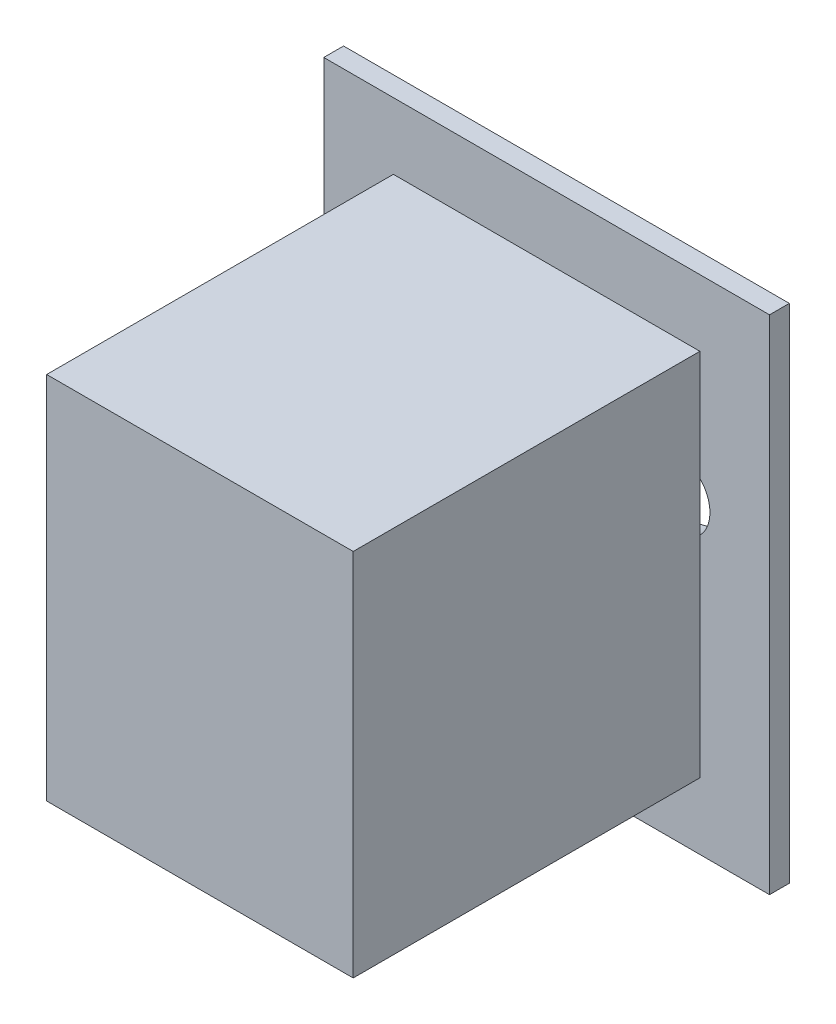
ISO-10303-21;
HEADER;
FILE_DESCRIPTION(('STEP AP214'),'2;1');
FILE_NAME('part.step','',(''),(''),'','','');
FILE_SCHEMA(('AUTOMOTIVE_DESIGN { 1 0 10303 214 1 1 1 1 }'));
ENDSEC;
DATA;
#1=APPLICATION_CONTEXT('core data for automotive mechanical design processes');
#2=APPLICATION_PROTOCOL_DEFINITION('international standard','automotive_design',2000,#1);
#3=PRODUCT_CONTEXT('',#1,'mechanical');
#4=PRODUCT('Part','Part','',(#3));
#5=PRODUCT_RELATED_PRODUCT_CATEGORY('part','',(#4));
#6=PRODUCT_DEFINITION_FORMATION('','',#4);
#7=PRODUCT_DEFINITION_CONTEXT('part definition',#1,'design');
#8=PRODUCT_DEFINITION('design','',#6,#7);
#9=PRODUCT_DEFINITION_SHAPE('','',#8);
#10=(LENGTH_UNIT() NAMED_UNIT(*) SI_UNIT(.MILLI.,.METRE.));
#11=(NAMED_UNIT(*) PLANE_ANGLE_UNIT() SI_UNIT($,.RADIAN.));
#12=(NAMED_UNIT(*) SI_UNIT($,.STERADIAN.) SOLID_ANGLE_UNIT());
#13=UNCERTAINTY_MEASURE_WITH_UNIT(LENGTH_MEASURE(1.E-05),#10,'distance_accuracy_value','');
#14=(GEOMETRIC_REPRESENTATION_CONTEXT(3) GLOBAL_UNCERTAINTY_ASSIGNED_CONTEXT((#13)) GLOBAL_UNIT_ASSIGNED_CONTEXT((#10,
#11,#12)) REPRESENTATION_CONTEXT('',''));
#15=CARTESIAN_POINT('',(0.,0.,0.));
#16=DIRECTION('',(0.,0.,1.));
#17=DIRECTION('',(1.,0.,0.));
#18=AXIS2_PLACEMENT_3D('',#15,#16,#17);
#19=CARTESIAN_POINT('',(0.,0.,2.));
#20=DIRECTION('',(0.,0.,-1.));
#21=DIRECTION('',(-1.,0.,0.));
#22=AXIS2_PLACEMENT_3D('',#19,#20,#21);
#23=PLANE('',#22);
#24=DIRECTION('',(0.,1.,0.));
#25=VECTOR('',#24,1.);
#26=CARTESIAN_POINT('',(22.5,-25.35,2.));
#27=LINE('',#26,#25);
#28=CARTESIAN_POINT('',(22.5,-25.35,2.));
#29=VERTEX_POINT('',#28);
#30=CARTESIAN_POINT('',(22.5,25.35,2.));
#31=VERTEX_POINT('',#30);
#32=EDGE_CURVE('E174',#29,#31,#27,.T.);
#33=ORIENTED_EDGE('',*,*,#32,.T.);
#34=DIRECTION('',(-1.,0.,0.));
#35=VECTOR('',#34,1.);
#36=CARTESIAN_POINT('',(-22.5,25.35,2.));
#37=LINE('',#36,#35);
#38=CARTESIAN_POINT('',(-22.5,25.35,2.));
#39=VERTEX_POINT('',#38);
#40=EDGE_CURVE('E177',#31,#39,#37,.T.);
#41=ORIENTED_EDGE('',*,*,#40,.T.);
#42=DIRECTION('',(0.,-1.,0.));
#43=VECTOR('',#42,1.);
#44=CARTESIAN_POINT('',(-22.5,-25.35,2.));
#45=LINE('',#44,#43);
#46=CARTESIAN_POINT('',(-22.5,-25.35,2.));
#47=VERTEX_POINT('',#46);
#48=EDGE_CURVE('E180',#39,#47,#45,.T.);
#49=ORIENTED_EDGE('',*,*,#48,.T.);
#50=DIRECTION('',(1.,0.,0.));
#51=VECTOR('',#50,1.);
#52=CARTESIAN_POINT('',(-22.5,-25.35,2.));
#53=LINE('',#52,#51);
#54=EDGE_CURVE('E182',#47,#29,#53,.T.);
#55=ORIENTED_EDGE('',*,*,#54,.T.);
#56=EDGE_LOOP('',(#33,#41,#49,#55));
#57=FACE_BOUND('',#56,.T.);
#58=DIRECTION('',(0.,1.,0.));
#59=VECTOR('',#58,1.);
#60=CARTESIAN_POINT('',(15.4718309454211,-18.6460204089014,2.));
#61=LINE('',#60,#59);
#62=CARTESIAN_POINT('',(15.4718309454211,-18.6460204089014,2.));
#63=VERTEX_POINT('',#62);
#64=CARTESIAN_POINT('',(15.4718309454211,2.56396348932195,2.));
#65=VERTEX_POINT('',#64);
#66=EDGE_CURVE('E52',#63,#65,#61,.T.);
#67=ORIENTED_EDGE('',*,*,#66,.F.);
#68=DIRECTION('',(1.,0.,0.));
#69=VECTOR('',#68,1.);
#70=CARTESIAN_POINT('',(-15.4718309454211,-18.6460204089014,2.));
#71=LINE('',#70,#69);
#72=CARTESIAN_POINT('',(-15.4718309454211,-18.6460204089014,2.));
#73=VERTEX_POINT('',#72);
#74=EDGE_CURVE('E56',#73,#63,#71,.T.);
#75=ORIENTED_EDGE('',*,*,#74,.F.);
#76=DIRECTION('',(0.,-1.,0.));
#77=VECTOR('',#76,1.);
#78=CARTESIAN_POINT('',(-15.4718309454211,-18.6460204089014,2.));
#79=LINE('',#78,#77);
#80=CARTESIAN_POINT('',(-15.4718309454211,2.56396348932196,2.));
#81=VERTEX_POINT('',#80);
#82=EDGE_CURVE('E11',#81,#73,#79,.T.);
#83=ORIENTED_EDGE('',*,*,#82,.F.);
#84=CARTESIAN_POINT('',(-12.9328988192172,5.05104631995179,2.));
#85=DIRECTION('',(0.,0.,1.));
#86=DIRECTION('',(1.,0.,0.));
#87=AXIS2_PLACEMENT_3D('',#84,#85,#86);
#88=CIRCLE('',#87,3.55411836436036);
#89=CARTESIAN_POINT('',(-15.4718309454211,7.53812915058162,2.));
#90=VERTEX_POINT('',#89);
#91=EDGE_CURVE('E162',#90,#81,#88,.T.);
#92=ORIENTED_EDGE('',*,*,#91,.F.);
#93=CARTESIAN_POINT('',(-15.4718309454211,18.6460204089014,2.));
#94=VERTEX_POINT('',#93);
#95=EDGE_CURVE('E44',#94,#90,#79,.T.);
#96=ORIENTED_EDGE('',*,*,#95,.F.);
#97=DIRECTION('',(-1.,0.,0.));
#98=VECTOR('',#97,1.);
#99=CARTESIAN_POINT('',(-15.4718309454211,18.6460204089014,2.));
#100=LINE('',#99,#98);
#101=CARTESIAN_POINT('',(15.4718309454211,18.6460204089014,2.));
#102=VERTEX_POINT('',#101);
#103=EDGE_CURVE('E209',#102,#94,#100,.T.);
#104=ORIENTED_EDGE('',*,*,#103,.F.);
#105=CARTESIAN_POINT('',(15.4718309454211,7.53812915058163,2.));
#106=VERTEX_POINT('',#105);
#107=EDGE_CURVE('E42',#106,#102,#61,.T.);
#108=ORIENTED_EDGE('',*,*,#107,.F.);
#109=CARTESIAN_POINT('',(12.9328988192172,5.05104631995179,2.));
#110=DIRECTION('',(0.,0.,1.));
#111=DIRECTION('',(-1.,0.,0.));
#112=AXIS2_PLACEMENT_3D('',#109,#110,#111);
#113=CIRCLE('',#112,3.55411836436037);
#114=EDGE_CURVE('E145',#65,#106,#113,.T.);
#115=ORIENTED_EDGE('',*,*,#114,.F.);
#116=EDGE_LOOP('',(#67,#75,#83,#92,#96,#104,#108,#115));
#117=FACE_BOUND('',#116,.T.);
#118=ADVANCED_FACE('F33',(#57,#117),#23,.F.);
#119=CARTESIAN_POINT('',(0.,0.,0.));
#120=DIRECTION('',(0.,0.,-1.));
#121=DIRECTION('',(-1.,0.,0.));
#122=AXIS2_PLACEMENT_3D('',#119,#120,#121);
#123=PLANE('',#122);
#124=CARTESIAN_POINT('',(9.04747857310047,-11.6007547348343,0.));
#125=DIRECTION('',(0.,0.,1.));
#126=DIRECTION('',(-1.,0.,0.));
#127=AXIS2_PLACEMENT_3D('',#124,#125,#126);
#128=CIRCLE('',#127,2.98908976718799);
#129=CARTESIAN_POINT('',(6.05838880591249,-11.6007547348343,0.));
#130=VERTEX_POINT('',#129);
#131=EDGE_CURVE('E148',#130,#130,#128,.T.);
#132=ORIENTED_EDGE('',*,*,#131,.T.);
#133=EDGE_LOOP('',(#132));
#134=FACE_BOUND('',#133,.T.);
#135=CARTESIAN_POINT('',(-12.9328988192172,5.05104631995179,0.));
#136=DIRECTION('',(0.,0.,1.));
#137=DIRECTION('',(1.,0.,0.));
#138=AXIS2_PLACEMENT_3D('',#135,#136,#137);
#139=CIRCLE('',#138,3.55411836436036);
#140=CARTESIAN_POINT('',(-9.37878045485687,5.05104631995179,0.));
#141=VERTEX_POINT('',#140);
#142=EDGE_CURVE('E161',#141,#141,#139,.T.);
#143=ORIENTED_EDGE('',*,*,#142,.T.);
#144=EDGE_LOOP('',(#143));
#145=FACE_BOUND('',#144,.T.);
#146=DIRECTION('',(0.,1.,0.));
#147=VECTOR('',#146,1.);
#148=CARTESIAN_POINT('',(22.5,-25.35,0.));
#149=LINE('',#148,#147);
#150=CARTESIAN_POINT('',(22.5,-25.35,0.));
#151=VERTEX_POINT('',#150);
#152=CARTESIAN_POINT('',(22.5,25.35,0.));
#153=VERTEX_POINT('',#152);
#154=EDGE_CURVE('E173',#151,#153,#149,.T.);
#155=ORIENTED_EDGE('',*,*,#154,.F.);
#156=DIRECTION('',(1.,0.,0.));
#157=VECTOR('',#156,1.);
#158=CARTESIAN_POINT('',(-22.5,-25.35,0.));
#159=LINE('',#158,#157);
#160=CARTESIAN_POINT('',(-22.5,-25.35,0.));
#161=VERTEX_POINT('',#160);
#162=EDGE_CURVE('E178',#161,#151,#159,.T.);
#163=ORIENTED_EDGE('',*,*,#162,.F.);
#164=DIRECTION('',(0.,-1.,0.));
#165=VECTOR('',#164,1.);
#166=CARTESIAN_POINT('',(-22.5,-25.35,0.));
#167=LINE('',#166,#165);
#168=CARTESIAN_POINT('',(-22.5,25.35,0.));
#169=VERTEX_POINT('',#168);
#170=EDGE_CURVE('E189',#169,#161,#167,.T.);
#171=ORIENTED_EDGE('',*,*,#170,.F.);
#172=DIRECTION('',(-1.,0.,0.));
#173=VECTOR('',#172,1.);
#174=CARTESIAN_POINT('',(-22.5,25.35,0.));
#175=LINE('',#174,#173);
#176=EDGE_CURVE('E187',#153,#169,#175,.T.);
#177=ORIENTED_EDGE('',*,*,#176,.F.);
#178=EDGE_LOOP('',(#155,#163,#171,#177));
#179=FACE_BOUND('',#178,.T.);
#180=CARTESIAN_POINT('',(0.,15.621214426785,0.));
#181=DIRECTION('',(0.,0.,1.));
#182=DIRECTION('',(1.,0.,0.));
#183=AXIS2_PLACEMENT_3D('',#180,#181,#182);
#184=CIRCLE('',#183,2.63697333588881);
#185=CARTESIAN_POINT('',(2.63697333588882,15.621214426785,0.));
#186=VERTEX_POINT('',#185);
#187=EDGE_CURVE('E165',#186,#186,#184,.T.);
#188=ORIENTED_EDGE('',*,*,#187,.T.);
#189=EDGE_LOOP('',(#188));
#190=FACE_BOUND('',#189,.T.);
#191=CARTESIAN_POINT('',(-9.04747857310047,-11.6007547348343,0.));
#192=DIRECTION('',(0.,0.,1.));
#193=DIRECTION('',(1.,0.,0.));
#194=AXIS2_PLACEMENT_3D('',#191,#192,#193);
#195=CIRCLE('',#194,2.98908976718798);
#196=CARTESIAN_POINT('',(-6.05838880591248,-11.6007547348343,0.));
#197=VERTEX_POINT('',#196);
#198=EDGE_CURVE('E156',#197,#197,#195,.T.);
#199=ORIENTED_EDGE('',*,*,#198,.T.);
#200=EDGE_LOOP('',(#199));
#201=FACE_BOUND('',#200,.T.);
#202=CARTESIAN_POINT('',(12.9328988192172,5.05104631995179,0.));
#203=DIRECTION('',(0.,0.,1.));
#204=DIRECTION('',(-1.,0.,0.));
#205=AXIS2_PLACEMENT_3D('',#202,#203,#204);
#206=CIRCLE('',#205,3.55411836436037);
#207=CARTESIAN_POINT('',(9.37878045485687,5.05104631995179,0.));
#208=VERTEX_POINT('',#207);
#209=EDGE_CURVE('E150',#208,#208,#206,.T.);
#210=ORIENTED_EDGE('',*,*,#209,.T.);
#211=EDGE_LOOP('',(#210));
#212=FACE_BOUND('',#211,.T.);
#213=ADVANCED_FACE('F253',(#134,#145,#179,#190,#201,#212),#123,.T.);
#214=CARTESIAN_POINT('',(22.5,-25.35,2.));
#215=DIRECTION('',(-1.,0.,0.));
#216=DIRECTION('',(0.,0.,1.));
#217=AXIS2_PLACEMENT_3D('',#214,#215,#216);
#218=PLANE('',#217);
#219=ORIENTED_EDGE('',*,*,#154,.T.);
#220=DIRECTION('',(0.,0.,-1.));
#221=VECTOR('',#220,1.);
#222=CARTESIAN_POINT('',(22.5,25.35,2.));
#223=LINE('',#222,#221);
#224=EDGE_CURVE('E37',#31,#153,#223,.T.);
#225=ORIENTED_EDGE('',*,*,#224,.F.);
#226=ORIENTED_EDGE('',*,*,#32,.F.);
#227=DIRECTION('',(0.,0.,-1.));
#228=VECTOR('',#227,1.);
#229=CARTESIAN_POINT('',(22.5,-25.35,2.));
#230=LINE('',#229,#228);
#231=EDGE_CURVE('E184',#29,#151,#230,.T.);
#232=ORIENTED_EDGE('',*,*,#231,.T.);
#233=EDGE_LOOP('',(#219,#225,#226,#232));
#234=FACE_BOUND('',#233,.T.);
#235=ADVANCED_FACE('F35',(#234),#218,.F.);
#236=CARTESIAN_POINT('',(-22.5,25.35,2.));
#237=DIRECTION('',(0.,-1.,0.));
#238=DIRECTION('',(0.,0.,-1.));
#239=AXIS2_PLACEMENT_3D('',#236,#237,#238);
#240=PLANE('',#239);
#241=ORIENTED_EDGE('',*,*,#176,.T.);
#242=DIRECTION('',(0.,0.,-1.));
#243=VECTOR('',#242,1.);
#244=CARTESIAN_POINT('',(-22.5,25.35,2.));
#245=LINE('',#244,#243);
#246=EDGE_CURVE('E196',#39,#169,#245,.T.);
#247=ORIENTED_EDGE('',*,*,#246,.F.);
#248=ORIENTED_EDGE('',*,*,#40,.F.);
#249=ORIENTED_EDGE('',*,*,#224,.T.);
#250=EDGE_LOOP('',(#241,#247,#248,#249));
#251=FACE_BOUND('',#250,.T.);
#252=ADVANCED_FACE('F273',(#251),#240,.F.);
#253=CARTESIAN_POINT('',(-22.5,-25.35,2.));
#254=DIRECTION('',(1.,0.,0.));
#255=DIRECTION('',(0.,0.,-1.));
#256=AXIS2_PLACEMENT_3D('',#253,#254,#255);
#257=PLANE('',#256);
#258=ORIENTED_EDGE('',*,*,#170,.T.);
#259=DIRECTION('',(0.,0.,-1.));
#260=VECTOR('',#259,1.);
#261=CARTESIAN_POINT('',(-22.5,-25.35,2.));
#262=LINE('',#261,#260);
#263=EDGE_CURVE('E194',#47,#161,#262,.T.);
#264=ORIENTED_EDGE('',*,*,#263,.F.);
#265=ORIENTED_EDGE('',*,*,#48,.F.);
#266=ORIENTED_EDGE('',*,*,#246,.T.);
#267=EDGE_LOOP('',(#258,#264,#265,#266));
#268=FACE_BOUND('',#267,.T.);
#269=ADVANCED_FACE('F270',(#268),#257,.F.);
#270=CARTESIAN_POINT('',(-22.5,-25.35,2.));
#271=DIRECTION('',(0.,1.,0.));
#272=DIRECTION('',(0.,0.,1.));
#273=AXIS2_PLACEMENT_3D('',#270,#271,#272);
#274=PLANE('',#273);
#275=ORIENTED_EDGE('',*,*,#162,.T.);
#276=ORIENTED_EDGE('',*,*,#231,.F.);
#277=ORIENTED_EDGE('',*,*,#54,.F.);
#278=ORIENTED_EDGE('',*,*,#263,.T.);
#279=EDGE_LOOP('',(#275,#276,#277,#278));
#280=FACE_BOUND('',#279,.T.);
#281=ADVANCED_FACE('F267',(#280),#274,.F.);
#282=CARTESIAN_POINT('',(0.,15.621214426785,2.));
#283=DIRECTION('',(0.,0.,-1.));
#284=DIRECTION('',(-1.,0.,0.));
#285=AXIS2_PLACEMENT_3D('',#282,#283,#284);
#286=CYLINDRICAL_SURFACE('',#285,2.63697333588881);
#287=CARTESIAN_POINT('',(0.,15.621214426785,2.));
#288=DIRECTION('',(0.,0.,1.));
#289=DIRECTION('',(1.,0.,0.));
#290=AXIS2_PLACEMENT_3D('',#287,#288,#289);
#291=CIRCLE('',#290,2.63697333588881);
#292=CARTESIAN_POINT('',(2.63697333588882,15.621214426785,2.));
#293=VERTEX_POINT('',#292);
#294=EDGE_CURVE('E152',#293,#293,#291,.T.);
#295=ORIENTED_EDGE('',*,*,#294,.T.);
#296=EDGE_LOOP('',(#295));
#297=FACE_BOUND('',#296,.T.);
#298=ORIENTED_EDGE('',*,*,#187,.F.);
#299=EDGE_LOOP('',(#298));
#300=FACE_BOUND('',#299,.T.);
#301=ADVANCED_FACE('F264',(#297,#300),#286,.F.);
#302=CARTESIAN_POINT('',(-12.9328988192172,5.05104631995179,2.));
#303=DIRECTION('',(0.,0.,-1.));
#304=DIRECTION('',(-1.,0.,0.));
#305=AXIS2_PLACEMENT_3D('',#302,#303,#304);
#306=CYLINDRICAL_SURFACE('',#305,3.55411836436036);
#307=ORIENTED_EDGE('',*,*,#91,.T.);
#308=EDGE_CURVE('E166',#81,#90,#88,.T.);
#309=ORIENTED_EDGE('',*,*,#308,.T.);
#310=EDGE_LOOP('',(#307,#309));
#311=FACE_BOUND('',#310,.T.);
#312=ORIENTED_EDGE('',*,*,#142,.F.);
#313=EDGE_LOOP('',(#312));
#314=FACE_BOUND('',#313,.T.);
#315=ADVANCED_FACE('F232',(#311,#314),#306,.F.);
#316=CARTESIAN_POINT('',(-9.04747857310047,-11.6007547348343,2.));
#317=DIRECTION('',(0.,0.,-1.));
#318=DIRECTION('',(-1.,0.,0.));
#319=AXIS2_PLACEMENT_3D('',#316,#317,#318);
#320=CYLINDRICAL_SURFACE('',#319,2.98908976718798);
#321=CARTESIAN_POINT('',(-9.04747857310047,-11.6007547348343,2.));
#322=DIRECTION('',(0.,0.,1.));
#323=DIRECTION('',(1.,0.,0.));
#324=AXIS2_PLACEMENT_3D('',#321,#322,#323);
#325=CIRCLE('',#324,2.98908976718798);
#326=CARTESIAN_POINT('',(-6.05838880591248,-11.6007547348343,2.));
#327=VERTEX_POINT('',#326);
#328=EDGE_CURVE('E139',#327,#327,#325,.T.);
#329=ORIENTED_EDGE('',*,*,#328,.T.);
#330=EDGE_LOOP('',(#329));
#331=FACE_BOUND('',#330,.T.);
#332=ORIENTED_EDGE('',*,*,#198,.F.);
#333=EDGE_LOOP('',(#332));
#334=FACE_BOUND('',#333,.T.);
#335=ADVANCED_FACE('F300',(#331,#334),#320,.F.);
#336=CARTESIAN_POINT('',(9.04747857310047,-11.6007547348343,2.));
#337=DIRECTION('',(0.,0.,-1.));
#338=DIRECTION('',(-1.,0.,0.));
#339=AXIS2_PLACEMENT_3D('',#336,#337,#338);
#340=CYLINDRICAL_SURFACE('',#339,2.98908976718799);
#341=CARTESIAN_POINT('',(9.04747857310047,-11.6007547348343,2.));
#342=DIRECTION('',(0.,0.,1.));
#343=DIRECTION('',(-1.,0.,0.));
#344=AXIS2_PLACEMENT_3D('',#341,#342,#343);
#345=CIRCLE('',#344,2.98908976718799);
#346=CARTESIAN_POINT('',(6.05838880591249,-11.6007547348343,2.));
#347=VERTEX_POINT('',#346);
#348=EDGE_CURVE('E136',#347,#347,#345,.T.);
#349=ORIENTED_EDGE('',*,*,#348,.T.);
#350=EDGE_LOOP('',(#349));
#351=FACE_BOUND('',#350,.T.);
#352=ORIENTED_EDGE('',*,*,#131,.F.);
#353=EDGE_LOOP('',(#352));
#354=FACE_BOUND('',#353,.T.);
#355=ADVANCED_FACE('F293',(#351,#354),#340,.F.);
#356=CARTESIAN_POINT('',(12.9328988192172,5.05104631995179,2.));
#357=DIRECTION('',(0.,0.,-1.));
#358=DIRECTION('',(-1.,0.,0.));
#359=AXIS2_PLACEMENT_3D('',#356,#357,#358);
#360=CYLINDRICAL_SURFACE('',#359,3.55411836436037);
#361=ORIENTED_EDGE('',*,*,#114,.T.);
#362=EDGE_CURVE('E149',#106,#65,#113,.T.);
#363=ORIENTED_EDGE('',*,*,#362,.T.);
#364=EDGE_LOOP('',(#361,#363));
#365=FACE_BOUND('',#364,.T.);
#366=ORIENTED_EDGE('',*,*,#209,.F.);
#367=EDGE_LOOP('',(#366));
#368=FACE_BOUND('',#367,.T.);
#369=ADVANCED_FACE('F215',(#365,#368),#360,.F.);
#370=CARTESIAN_POINT('',(0.,0.,37.));
#371=DIRECTION('',(0.,0.,-1.));
#372=DIRECTION('',(-1.,0.,0.));
#373=AXIS2_PLACEMENT_3D('',#370,#371,#372);
#374=PLANE('',#373);
#375=DIRECTION('',(0.,1.,0.));
#376=VECTOR('',#375,1.);
#377=CARTESIAN_POINT('',(15.4718309454211,-18.6460204089014,37.));
#378=LINE('',#377,#376);
#379=CARTESIAN_POINT('',(15.4718309454211,-18.6460204089014,37.));
#380=VERTEX_POINT('',#379);
#381=CARTESIAN_POINT('',(15.4718309454211,18.6460204089014,37.));
#382=VERTEX_POINT('',#381);
#383=EDGE_CURVE('E123',#380,#382,#378,.T.);
#384=ORIENTED_EDGE('',*,*,#383,.T.);
#385=DIRECTION('',(-1.,0.,0.));
#386=VECTOR('',#385,1.);
#387=CARTESIAN_POINT('',(-15.4718309454211,18.6460204089014,37.));
#388=LINE('',#387,#386);
#389=CARTESIAN_POINT('',(-15.4718309454211,18.6460204089014,37.));
#390=VERTEX_POINT('',#389);
#391=EDGE_CURVE('E112',#382,#390,#388,.T.);
#392=ORIENTED_EDGE('',*,*,#391,.T.);
#393=DIRECTION('',(0.,-1.,0.));
#394=VECTOR('',#393,1.);
#395=CARTESIAN_POINT('',(-15.4718309454211,-18.6460204089014,37.));
#396=LINE('',#395,#394);
#397=CARTESIAN_POINT('',(-15.4718309454211,-18.6460204089014,37.));
#398=VERTEX_POINT('',#397);
#399=EDGE_CURVE('E122',#390,#398,#396,.T.);
#400=ORIENTED_EDGE('',*,*,#399,.T.);
#401=DIRECTION('',(1.,0.,0.));
#402=VECTOR('',#401,1.);
#403=CARTESIAN_POINT('',(-15.4718309454211,-18.6460204089014,37.));
#404=LINE('',#403,#402);
#405=EDGE_CURVE('E128',#398,#380,#404,.T.);
#406=ORIENTED_EDGE('',*,*,#405,.T.);
#407=EDGE_LOOP('',(#384,#392,#400,#406));
#408=FACE_BOUND('',#407,.T.);
#409=ADVANCED_FACE('F126',(#408),#374,.F.);
#410=CARTESIAN_POINT('',(-15.4718309454211,-18.6460204089014,37.));
#411=DIRECTION('',(0.,1.,0.));
#412=DIRECTION('',(0.,0.,1.));
#413=AXIS2_PLACEMENT_3D('',#410,#411,#412);
#414=PLANE('',#413);
#415=ORIENTED_EDGE('',*,*,#74,.T.);
#416=DIRECTION('',(0.,0.,-1.));
#417=VECTOR('',#416,1.);
#418=CARTESIAN_POINT('',(15.4718309454211,-18.6460204089014,37.));
#419=LINE('',#418,#417);
#420=EDGE_CURVE('E222',#380,#63,#419,.T.);
#421=ORIENTED_EDGE('',*,*,#420,.F.);
#422=ORIENTED_EDGE('',*,*,#405,.F.);
#423=DIRECTION('',(0.,0.,-1.));
#424=VECTOR('',#423,1.);
#425=CARTESIAN_POINT('',(-15.4718309454211,-18.6460204089014,37.));
#426=LINE('',#425,#424);
#427=EDGE_CURVE('E141',#398,#73,#426,.T.);
#428=ORIENTED_EDGE('',*,*,#427,.T.);
#429=EDGE_LOOP('',(#415,#421,#422,#428));
#430=FACE_BOUND('',#429,.T.);
#431=ADVANCED_FACE('F226',(#430),#414,.F.);
#432=CARTESIAN_POINT('',(-15.4718309454211,-18.6460204089014,37.));
#433=DIRECTION('',(1.,0.,0.));
#434=DIRECTION('',(0.,0.,-1.));
#435=AXIS2_PLACEMENT_3D('',#432,#433,#434);
#436=PLANE('',#435);
#437=ORIENTED_EDGE('',*,*,#95,.T.);
#438=EDGE_CURVE('E45',#90,#81,#79,.T.);
#439=ORIENTED_EDGE('',*,*,#438,.T.);
#440=ORIENTED_EDGE('',*,*,#82,.T.);
#441=ORIENTED_EDGE('',*,*,#427,.F.);
#442=ORIENTED_EDGE('',*,*,#399,.F.);
#443=DIRECTION('',(0.,0.,-1.));
#444=VECTOR('',#443,1.);
#445=CARTESIAN_POINT('',(-15.4718309454211,18.6460204089014,37.));
#446=LINE('',#445,#444);
#447=EDGE_CURVE('E119',#390,#94,#446,.T.);
#448=ORIENTED_EDGE('',*,*,#447,.T.);
#449=EDGE_LOOP('',(#437,#439,#440,#441,#442,#448));
#450=FACE_BOUND('',#449,.T.);
#451=ADVANCED_FACE('F228',(#450),#436,.F.);
#452=CARTESIAN_POINT('',(-15.4718309454211,18.6460204089014,37.));
#453=DIRECTION('',(0.,-1.,0.));
#454=DIRECTION('',(0.,0.,-1.));
#455=AXIS2_PLACEMENT_3D('',#452,#453,#454);
#456=PLANE('',#455);
#457=ORIENTED_EDGE('',*,*,#103,.T.);
#458=ORIENTED_EDGE('',*,*,#447,.F.);
#459=ORIENTED_EDGE('',*,*,#391,.F.);
#460=DIRECTION('',(0.,0.,-1.));
#461=VECTOR('',#460,1.);
#462=CARTESIAN_POINT('',(15.4718309454211,18.6460204089014,37.));
#463=LINE('',#462,#461);
#464=EDGE_CURVE('E117',#382,#102,#463,.T.);
#465=ORIENTED_EDGE('',*,*,#464,.T.);
#466=EDGE_LOOP('',(#457,#458,#459,#465));
#467=FACE_BOUND('',#466,.T.);
#468=ADVANCED_FACE('F115',(#467),#456,.F.);
#469=CARTESIAN_POINT('',(15.4718309454211,-18.6460204089014,37.));
#470=DIRECTION('',(-1.,0.,0.));
#471=DIRECTION('',(0.,0.,1.));
#472=AXIS2_PLACEMENT_3D('',#469,#470,#471);
#473=PLANE('',#472);
#474=ORIENTED_EDGE('',*,*,#66,.T.);
#475=EDGE_CURVE('E206',#65,#106,#61,.T.);
#476=ORIENTED_EDGE('',*,*,#475,.T.);
#477=ORIENTED_EDGE('',*,*,#107,.T.);
#478=ORIENTED_EDGE('',*,*,#464,.F.);
#479=ORIENTED_EDGE('',*,*,#383,.F.);
#480=ORIENTED_EDGE('',*,*,#420,.T.);
#481=EDGE_LOOP('',(#474,#476,#477,#478,#479,#480));
#482=FACE_BOUND('',#481,.T.);
#483=ADVANCED_FACE('F134',(#482),#473,.F.);
#484=CARTESIAN_POINT('',(0.,0.,2.));
#485=DIRECTION('',(0.,0.,-1.));
#486=DIRECTION('',(-1.,0.,0.));
#487=AXIS2_PLACEMENT_3D('',#484,#485,#486);
#488=PLANE('',#487);
#489=ORIENTED_EDGE('',*,*,#362,.F.);
#490=ORIENTED_EDGE('',*,*,#475,.F.);
#491=EDGE_LOOP('',(#489,#490));
#492=FACE_BOUND('',#491,.T.);
#493=ADVANCED_FACE('F213',(#492),#488,.T.);
#494=ORIENTED_EDGE('',*,*,#308,.F.);
#495=ORIENTED_EDGE('',*,*,#438,.F.);
#496=EDGE_LOOP('',(#494,#495));
#497=FACE_BOUND('',#496,.T.);
#498=ADVANCED_FACE('F235',(#497),#488,.T.);
#499=ORIENTED_EDGE('',*,*,#348,.F.);
#500=EDGE_LOOP('',(#499));
#501=FACE_BOUND('',#500,.T.);
#502=ADVANCED_FACE('F237',(#501),#488,.T.);
#503=ORIENTED_EDGE('',*,*,#328,.F.);
#504=EDGE_LOOP('',(#503));
#505=FACE_BOUND('',#504,.T.);
#506=ADVANCED_FACE('F239',(#505),#488,.T.);
#507=ORIENTED_EDGE('',*,*,#294,.F.);
#508=EDGE_LOOP('',(#507));
#509=FACE_BOUND('',#508,.T.);
#510=ADVANCED_FACE('F240',(#509),#488,.T.);
#511=CLOSED_SHELL('',(#118,#213,#235,#252,#269,#281,#301,#315,#335,#355,#369,#409,#431,#451,
#468,#483,#493,#498,#502,#506,#510));
#512=MANIFOLD_SOLID_BREP('B2',#511);
#513=ADVANCED_BREP_SHAPE_REPRESENTATION('',(#18,#512),#14);
#514=SHAPE_DEFINITION_REPRESENTATION(#9,#513);
ENDSEC;
END-ISO-10303-21;
